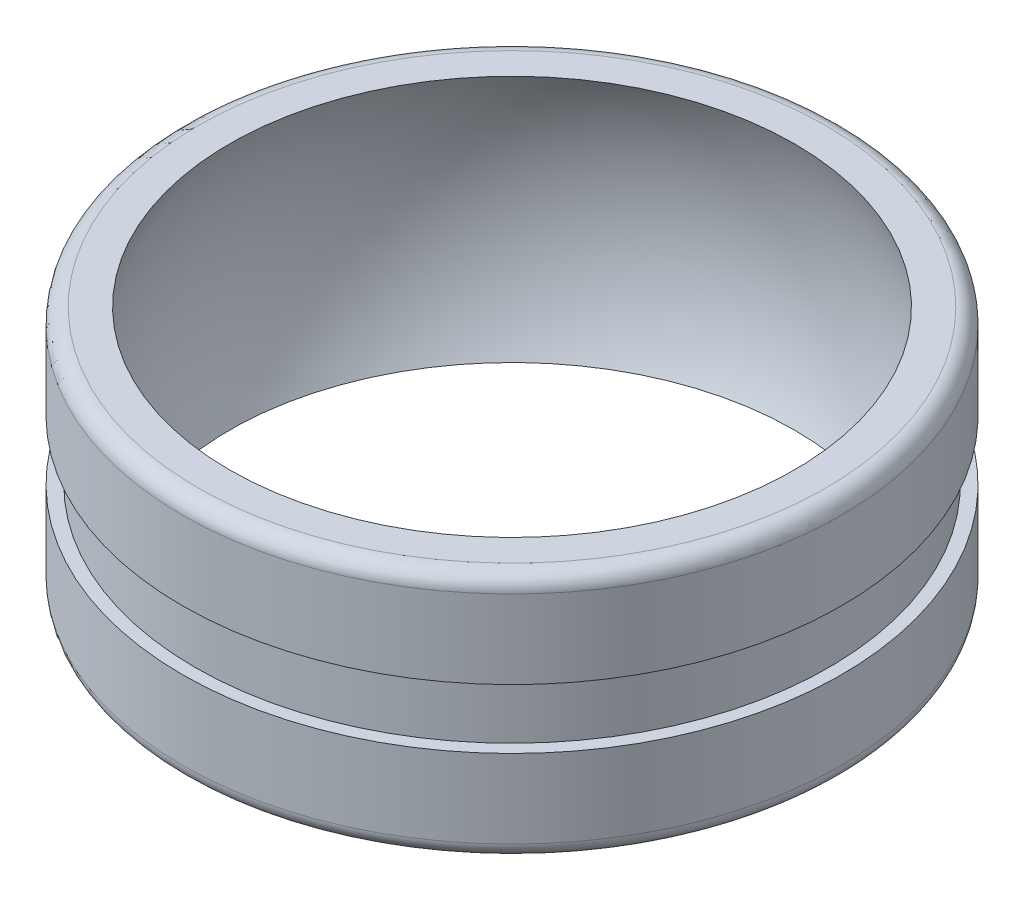
ISO-10303-21;
HEADER;
FILE_DESCRIPTION(('STEP AP214'),'2;1');
FILE_NAME('part.step','',(''),(''),'','','');
FILE_SCHEMA(('AUTOMOTIVE_DESIGN { 1 0 10303 214 1 1 1 1 }'));
ENDSEC;
DATA;
#1=APPLICATION_CONTEXT('core data for automotive mechanical design processes');
#2=APPLICATION_PROTOCOL_DEFINITION('international standard','automotive_design',2000,#1);
#3=PRODUCT_CONTEXT('',#1,'mechanical');
#4=PRODUCT('Part','Part','',(#3));
#5=PRODUCT_RELATED_PRODUCT_CATEGORY('part','',(#4));
#6=PRODUCT_DEFINITION_FORMATION('','',#4);
#7=PRODUCT_DEFINITION_CONTEXT('part definition',#1,'design');
#8=PRODUCT_DEFINITION('design','',#6,#7);
#9=PRODUCT_DEFINITION_SHAPE('','',#8);
#10=(LENGTH_UNIT() NAMED_UNIT(*) SI_UNIT(.MILLI.,.METRE.));
#11=(NAMED_UNIT(*) PLANE_ANGLE_UNIT() SI_UNIT($,.RADIAN.));
#12=(NAMED_UNIT(*) SI_UNIT($,.STERADIAN.) SOLID_ANGLE_UNIT());
#13=UNCERTAINTY_MEASURE_WITH_UNIT(LENGTH_MEASURE(1.E-05),#10,'distance_accuracy_value','');
#14=(GEOMETRIC_REPRESENTATION_CONTEXT(3) GLOBAL_UNCERTAINTY_ASSIGNED_CONTEXT((#13)) GLOBAL_UNIT_ASSIGNED_CONTEXT((#10,
#11,#12)) REPRESENTATION_CONTEXT('',''));
#15=CARTESIAN_POINT('',(0.,0.,0.));
#16=DIRECTION('',(0.,0.,1.));
#17=DIRECTION('',(1.,0.,0.));
#18=AXIS2_PLACEMENT_3D('',#15,#16,#17);
#19=CARTESIAN_POINT('',(0.,0.,0.));
#20=DIRECTION('',(0.,1.,0.));
#21=DIRECTION('',(0.,0.,1.));
#22=AXIS2_PLACEMENT_3D('',#19,#20,#21);
#23=DEGENERATE_TOROIDAL_SURFACE('',#22,1.82625584473404,18.,.T.);
#24=CARTESIAN_POINT('',(0.,-7.9,0.));
#25=DIRECTION('',(0.,1.,0.));
#26=DIRECTION('',(0.,0.,1.));
#27=AXIS2_PLACEMENT_3D('',#24,#25,#26);
#28=CIRCLE('',#27,18.);
#29=CARTESIAN_POINT('',(0.,-7.90000000000001,18.));
#30=VERTEX_POINT('',#29);
#31=EDGE_CURVE('E68',#30,#30,#28,.T.);
#32=ORIENTED_EDGE('',*,*,#31,.F.);
#33=EDGE_LOOP('',(#32));
#34=FACE_BOUND('',#33,.T.);
#35=CARTESIAN_POINT('',(0.,7.9,0.));
#36=DIRECTION('',(0.,1.,0.));
#37=DIRECTION('',(0.,0.,1.));
#38=AXIS2_PLACEMENT_3D('',#35,#36,#37);
#39=CIRCLE('',#38,18.);
#40=CARTESIAN_POINT('',(0.,7.89999999999999,18.));
#41=VERTEX_POINT('',#40);
#42=EDGE_CURVE('E53',#41,#41,#39,.T.);
#43=ORIENTED_EDGE('',*,*,#42,.T.);
#44=EDGE_LOOP('',(#43));
#45=FACE_BOUND('',#44,.T.);
#46=ADVANCED_FACE('F33',(#34,#45),#23,.F.);
#47=CARTESIAN_POINT('',(0.,7.9,-21.));
#48=DIRECTION('',(0.,-1.,0.));
#49=DIRECTION('',(0.,0.,-1.));
#50=AXIS2_PLACEMENT_3D('',#47,#48,#49);
#51=PLANE('',#50);
#52=CARTESIAN_POINT('',(0.,7.9,0.));
#53=DIRECTION('',(0.,-1.,0.));
#54=DIRECTION('',(0.,0.,-1.));
#55=AXIS2_PLACEMENT_3D('',#52,#53,#54);
#56=CIRCLE('',#55,20.);
#57=CARTESIAN_POINT('',(0.,7.9,-20.));
#58=VERTEX_POINT('',#57);
#59=EDGE_CURVE('E40',#58,#58,#56,.F.);
#60=ORIENTED_EDGE('',*,*,#59,.T.);
#61=EDGE_LOOP('',(#60));
#62=FACE_BOUND('',#61,.T.);
#63=ORIENTED_EDGE('',*,*,#42,.F.);
#64=EDGE_LOOP('',(#63));
#65=FACE_BOUND('',#64,.T.);
#66=ADVANCED_FACE('F76',(#62,#65),#51,.F.);
#67=CARTESIAN_POINT('',(0.,7.9,0.));
#68=DIRECTION('',(0.,1.,0.));
#69=DIRECTION('',(0.,0.,1.));
#70=AXIS2_PLACEMENT_3D('',#67,#68,#69);
#71=CYLINDRICAL_SURFACE('',#70,21.);
#72=CARTESIAN_POINT('',(0.,6.9,0.));
#73=DIRECTION('',(0.,-1.,0.));
#74=DIRECTION('',(0.,0.,-1.));
#75=AXIS2_PLACEMENT_3D('',#72,#73,#74);
#76=CIRCLE('',#75,21.);
#77=CARTESIAN_POINT('',(0.,6.9,-21.));
#78=VERTEX_POINT('',#77);
#79=EDGE_CURVE('E10',#78,#78,#76,.T.);
#80=ORIENTED_EDGE('',*,*,#79,.T.);
#81=EDGE_LOOP('',(#80));
#82=FACE_BOUND('',#81,.T.);
#83=CARTESIAN_POINT('',(0.,1.9,0.));
#84=DIRECTION('',(0.,1.,0.));
#85=DIRECTION('',(0.,0.,1.));
#86=AXIS2_PLACEMENT_3D('',#83,#84,#85);
#87=CIRCLE('',#86,21.);
#88=CARTESIAN_POINT('',(0.,1.89999999999999,21.));
#89=VERTEX_POINT('',#88);
#90=EDGE_CURVE('E56',#89,#89,#87,.T.);
#91=ORIENTED_EDGE('',*,*,#90,.T.);
#92=EDGE_LOOP('',(#91));
#93=FACE_BOUND('',#92,.T.);
#94=ADVANCED_FACE('F81',(#82,#93),#71,.T.);
#95=CARTESIAN_POINT('',(0.,1.9,-21.));
#96=DIRECTION('',(0.,1.,0.));
#97=DIRECTION('',(0.,0.,1.));
#98=AXIS2_PLACEMENT_3D('',#95,#96,#97);
#99=PLANE('',#98);
#100=ORIENTED_EDGE('',*,*,#90,.F.);
#101=EDGE_LOOP('',(#100));
#102=FACE_BOUND('',#101,.T.);
#103=CARTESIAN_POINT('',(0.,1.9,0.));
#104=DIRECTION('',(0.,1.,0.));
#105=DIRECTION('',(0.,0.,1.));
#106=AXIS2_PLACEMENT_3D('',#103,#104,#105);
#107=CIRCLE('',#106,20.2);
#108=CARTESIAN_POINT('',(0.,1.89999999999999,20.2));
#109=VERTEX_POINT('',#108);
#110=EDGE_CURVE('E59',#109,#109,#107,.T.);
#111=ORIENTED_EDGE('',*,*,#110,.T.);
#112=EDGE_LOOP('',(#111));
#113=FACE_BOUND('',#112,.T.);
#114=ADVANCED_FACE('F86',(#102,#113),#99,.F.);
#115=CARTESIAN_POINT('',(0.,7.9,0.));
#116=DIRECTION('',(0.,1.,0.));
#117=DIRECTION('',(0.,0.,1.));
#118=AXIS2_PLACEMENT_3D('',#115,#116,#117);
#119=CYLINDRICAL_SURFACE('',#118,20.2);
#120=ORIENTED_EDGE('',*,*,#110,.F.);
#121=EDGE_LOOP('',(#120));
#122=FACE_BOUND('',#121,.T.);
#123=CARTESIAN_POINT('',(0.,-1.9,0.));
#124=DIRECTION('',(0.,1.,0.));
#125=DIRECTION('',(0.,0.,1.));
#126=AXIS2_PLACEMENT_3D('',#123,#124,#125);
#127=CIRCLE('',#126,20.2);
#128=CARTESIAN_POINT('',(0.,-1.90000000000001,20.2));
#129=VERTEX_POINT('',#128);
#130=EDGE_CURVE('E62',#129,#129,#127,.T.);
#131=ORIENTED_EDGE('',*,*,#130,.T.);
#132=EDGE_LOOP('',(#131));
#133=FACE_BOUND('',#132,.T.);
#134=ADVANCED_FACE('F111',(#122,#133),#119,.T.);
#135=CARTESIAN_POINT('',(0.,-1.9,-20.2));
#136=DIRECTION('',(0.,-1.,0.));
#137=DIRECTION('',(0.,0.,-1.));
#138=AXIS2_PLACEMENT_3D('',#135,#136,#137);
#139=PLANE('',#138);
#140=ORIENTED_EDGE('',*,*,#130,.F.);
#141=EDGE_LOOP('',(#140));
#142=FACE_BOUND('',#141,.T.);
#143=CARTESIAN_POINT('',(0.,-1.9,0.));
#144=DIRECTION('',(0.,1.,0.));
#145=DIRECTION('',(0.,0.,1.));
#146=AXIS2_PLACEMENT_3D('',#143,#144,#145);
#147=CIRCLE('',#146,21.);
#148=CARTESIAN_POINT('',(0.,-1.90000000000001,21.));
#149=VERTEX_POINT('',#148);
#150=EDGE_CURVE('E65',#149,#149,#147,.T.);
#151=ORIENTED_EDGE('',*,*,#150,.T.);
#152=EDGE_LOOP('',(#151));
#153=FACE_BOUND('',#152,.T.);
#154=ADVANCED_FACE('F106',(#142,#153),#139,.F.);
#155=CARTESIAN_POINT('',(0.,7.9,0.));
#156=DIRECTION('',(0.,1.,0.));
#157=DIRECTION('',(0.,0.,1.));
#158=AXIS2_PLACEMENT_3D('',#155,#156,#157);
#159=CYLINDRICAL_SURFACE('',#158,21.);
#160=CARTESIAN_POINT('',(0.,-6.9,0.));
#161=DIRECTION('',(0.,1.,0.));
#162=DIRECTION('',(0.,0.,1.));
#163=AXIS2_PLACEMENT_3D('',#160,#161,#162);
#164=CIRCLE('',#163,21.);
#165=CARTESIAN_POINT('',(0.,-6.90000000000001,21.));
#166=VERTEX_POINT('',#165);
#167=EDGE_CURVE('E48',#166,#166,#164,.T.);
#168=ORIENTED_EDGE('',*,*,#167,.T.);
#169=EDGE_LOOP('',(#168));
#170=FACE_BOUND('',#169,.T.);
#171=ORIENTED_EDGE('',*,*,#150,.F.);
#172=EDGE_LOOP('',(#171));
#173=FACE_BOUND('',#172,.T.);
#174=ADVANCED_FACE('F97',(#170,#173),#159,.T.);
#175=CARTESIAN_POINT('',(0.,-7.9,-18.));
#176=DIRECTION('',(0.,1.,0.));
#177=DIRECTION('',(0.,0.,1.));
#178=AXIS2_PLACEMENT_3D('',#175,#176,#177);
#179=PLANE('',#178);
#180=CARTESIAN_POINT('',(0.,-7.9,0.));
#181=DIRECTION('',(0.,1.,0.));
#182=DIRECTION('',(0.,0.,1.));
#183=AXIS2_PLACEMENT_3D('',#180,#181,#182);
#184=CIRCLE('',#183,20.);
#185=CARTESIAN_POINT('',(0.,-7.90000000000001,20.));
#186=VERTEX_POINT('',#185);
#187=EDGE_CURVE('E44',#186,#186,#184,.F.);
#188=ORIENTED_EDGE('',*,*,#187,.T.);
#189=EDGE_LOOP('',(#188));
#190=FACE_BOUND('',#189,.T.);
#191=ORIENTED_EDGE('',*,*,#31,.T.);
#192=EDGE_LOOP('',(#191));
#193=FACE_BOUND('',#192,.T.);
#194=ADVANCED_FACE('F72',(#190,#193),#179,.F.);
#195=CARTESIAN_POINT('',(0.,-6.9,0.));
#196=DIRECTION('',(0.,1.,0.));
#197=DIRECTION('',(0.,0.,1.));
#198=AXIS2_PLACEMENT_3D('',#195,#196,#197);
#199=TOROIDAL_SURFACE('',#198,20.,1.);
#200=ORIENTED_EDGE('',*,*,#187,.F.);
#201=EDGE_LOOP('',(#200));
#202=FACE_BOUND('',#201,.T.);
#203=ORIENTED_EDGE('',*,*,#167,.F.);
#204=EDGE_LOOP('',(#203));
#205=FACE_BOUND('',#204,.T.);
#206=ADVANCED_FACE('F89',(#202,#205),#199,.T.);
#207=CARTESIAN_POINT('',(0.,6.9,0.));
#208=DIRECTION('',(0.,-1.,0.));
#209=DIRECTION('',(0.,0.,-1.));
#210=AXIS2_PLACEMENT_3D('',#207,#208,#209);
#211=TOROIDAL_SURFACE('',#210,20.,1.);
#212=ORIENTED_EDGE('',*,*,#79,.F.);
#213=EDGE_LOOP('',(#212));
#214=FACE_BOUND('',#213,.T.);
#215=ORIENTED_EDGE('',*,*,#59,.F.);
#216=EDGE_LOOP('',(#215));
#217=FACE_BOUND('',#216,.T.);
#218=ADVANCED_FACE('F35',(#214,#217),#211,.T.);
#219=CLOSED_SHELL('',(#46,#66,#94,#114,#134,#154,#174,#194,#206,#218));
#220=MANIFOLD_SOLID_BREP('B2',#219);
#221=ADVANCED_BREP_SHAPE_REPRESENTATION('',(#18,#220),#14);
#222=SHAPE_DEFINITION_REPRESENTATION(#9,#221);
ENDSEC;
END-ISO-10303-21;
